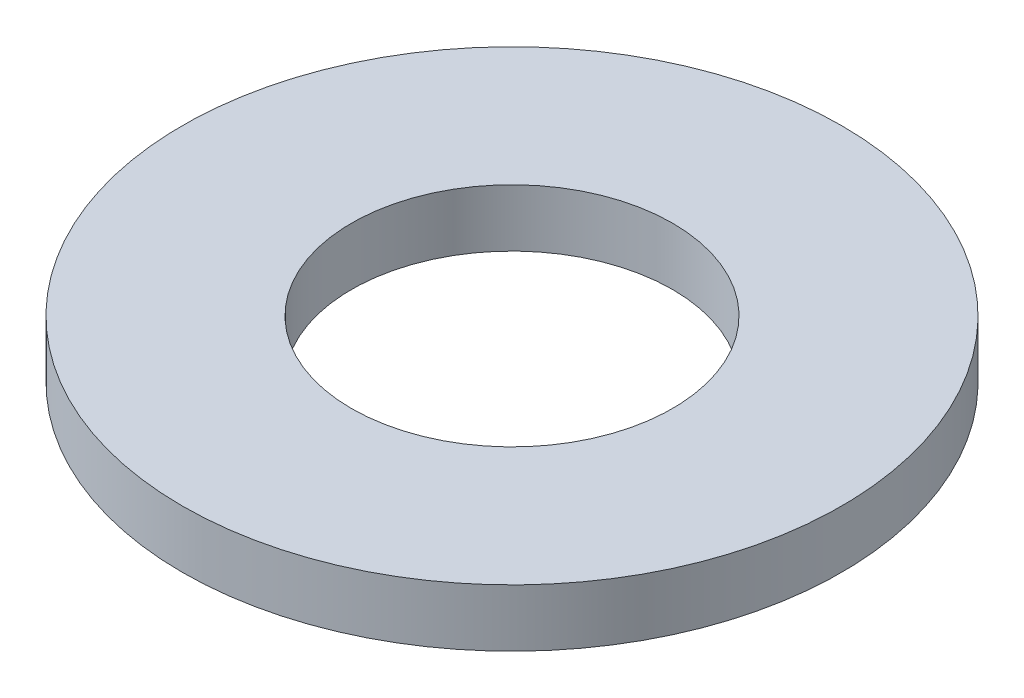
ISO-10303-21;
HEADER;
FILE_DESCRIPTION(('STEP AP214'),'2;1');
FILE_NAME('part.step','',(''),(''),'','','');
FILE_SCHEMA(('AUTOMOTIVE_DESIGN { 1 0 10303 214 1 1 1 1 }'));
ENDSEC;
DATA;
#1=APPLICATION_CONTEXT('core data for automotive mechanical design processes');
#2=APPLICATION_PROTOCOL_DEFINITION('international standard','automotive_design',2000,#1);
#3=PRODUCT_CONTEXT('',#1,'mechanical');
#4=PRODUCT('Part','Part','',(#3));
#5=PRODUCT_RELATED_PRODUCT_CATEGORY('part','',(#4));
#6=PRODUCT_DEFINITION_FORMATION('','',#4);
#7=PRODUCT_DEFINITION_CONTEXT('part definition',#1,'design');
#8=PRODUCT_DEFINITION('design','',#6,#7);
#9=PRODUCT_DEFINITION_SHAPE('','',#8);
#10=(LENGTH_UNIT() NAMED_UNIT(*) SI_UNIT(.MILLI.,.METRE.));
#11=(NAMED_UNIT(*) PLANE_ANGLE_UNIT() SI_UNIT($,.RADIAN.));
#12=(NAMED_UNIT(*) SI_UNIT($,.STERADIAN.) SOLID_ANGLE_UNIT());
#13=UNCERTAINTY_MEASURE_WITH_UNIT(LENGTH_MEASURE(1.E-05),#10,'distance_accuracy_value','');
#14=(GEOMETRIC_REPRESENTATION_CONTEXT(3) GLOBAL_UNCERTAINTY_ASSIGNED_CONTEXT((#13)) GLOBAL_UNIT_ASSIGNED_CONTEXT((#10,
#11,#12)) REPRESENTATION_CONTEXT('',''));
#15=CARTESIAN_POINT('',(0.,0.,0.));
#16=DIRECTION('',(0.,0.,1.));
#17=DIRECTION('',(1.,0.,0.));
#18=AXIS2_PLACEMENT_3D('',#15,#16,#17);
#19=CARTESIAN_POINT('',(0.,17.,0.));
#20=DIRECTION('',(0.,-1.,0.));
#21=DIRECTION('',(0.,0.,-1.));
#22=AXIS2_PLACEMENT_3D('',#19,#20,#21);
#23=CYLINDRICAL_SURFACE('',#22,97.5);
#24=CARTESIAN_POINT('',(0.,17.,0.));
#25=DIRECTION('',(0.,1.,0.));
#26=DIRECTION('',(0.,0.,1.));
#27=AXIS2_PLACEMENT_3D('',#24,#25,#26);
#28=CIRCLE('',#27,97.5);
#29=CARTESIAN_POINT('',(0.,17.,97.5));
#30=VERTEX_POINT('',#29);
#31=EDGE_CURVE('E10',#30,#30,#28,.T.);
#32=ORIENTED_EDGE('',*,*,#31,.F.);
#33=EDGE_LOOP('',(#32));
#34=FACE_BOUND('',#33,.T.);
#35=CARTESIAN_POINT('',(0.,0.,0.));
#36=DIRECTION('',(0.,1.,0.));
#37=DIRECTION('',(0.,0.,1.));
#38=AXIS2_PLACEMENT_3D('',#35,#36,#37);
#39=CIRCLE('',#38,97.5);
#40=CARTESIAN_POINT('',(0.,0.,97.5));
#41=VERTEX_POINT('',#40);
#42=EDGE_CURVE('E37',#41,#41,#39,.T.);
#43=ORIENTED_EDGE('',*,*,#42,.T.);
#44=EDGE_LOOP('',(#43));
#45=FACE_BOUND('',#44,.T.);
#46=ADVANCED_FACE('F40',(#34,#45),#23,.T.);
#47=CARTESIAN_POINT('',(0.,17.,0.));
#48=DIRECTION('',(0.,1.,0.));
#49=DIRECTION('',(0.,0.,1.));
#50=AXIS2_PLACEMENT_3D('',#47,#48,#49);
#51=PLANE('',#50);
#52=CARTESIAN_POINT('',(0.,17.,0.));
#53=DIRECTION('',(0.,1.,0.));
#54=DIRECTION('',(0.,0.,1.));
#55=AXIS2_PLACEMENT_3D('',#52,#53,#54);
#56=CIRCLE('',#55,47.5);
#57=CARTESIAN_POINT('',(0.,17.,47.5));
#58=VERTEX_POINT('',#57);
#59=EDGE_CURVE('E50',#58,#58,#56,.T.);
#60=ORIENTED_EDGE('',*,*,#59,.F.);
#61=EDGE_LOOP('',(#60));
#62=FACE_BOUND('',#61,.T.);
#63=ORIENTED_EDGE('',*,*,#31,.T.);
#64=EDGE_LOOP('',(#63));
#65=FACE_BOUND('',#64,.T.);
#66=ADVANCED_FACE('F59',(#62,#65),#51,.T.);
#67=CARTESIAN_POINT('',(0.,0.,0.));
#68=DIRECTION('',(0.,1.,0.));
#69=DIRECTION('',(0.,0.,1.));
#70=AXIS2_PLACEMENT_3D('',#67,#68,#69);
#71=PLANE('',#70);
#72=CARTESIAN_POINT('',(0.,0.,0.));
#73=DIRECTION('',(0.,1.,0.));
#74=DIRECTION('',(0.,0.,1.));
#75=AXIS2_PLACEMENT_3D('',#72,#73,#74);
#76=CIRCLE('',#75,47.5);
#77=CARTESIAN_POINT('',(0.,0.,47.5));
#78=VERTEX_POINT('',#77);
#79=EDGE_CURVE('E47',#78,#78,#76,.T.);
#80=ORIENTED_EDGE('',*,*,#79,.T.);
#81=EDGE_LOOP('',(#80));
#82=FACE_BOUND('',#81,.T.);
#83=ORIENTED_EDGE('',*,*,#42,.F.);
#84=EDGE_LOOP('',(#83));
#85=FACE_BOUND('',#84,.T.);
#86=ADVANCED_FACE('F58',(#82,#85),#71,.F.);
#87=CARTESIAN_POINT('',(0.,17.,0.));
#88=DIRECTION('',(0.,-1.,0.));
#89=DIRECTION('',(0.,0.,-1.));
#90=AXIS2_PLACEMENT_3D('',#87,#88,#89);
#91=CYLINDRICAL_SURFACE('',#90,47.5);
#92=ORIENTED_EDGE('',*,*,#59,.T.);
#93=EDGE_LOOP('',(#92));
#94=FACE_BOUND('',#93,.T.);
#95=ORIENTED_EDGE('',*,*,#79,.F.);
#96=EDGE_LOOP('',(#95));
#97=FACE_BOUND('',#96,.T.);
#98=ADVANCED_FACE('F54',(#94,#97),#91,.F.);
#99=CLOSED_SHELL('',(#46,#66,#86,#98));
#100=MANIFOLD_SOLID_BREP('B2',#99);
#101=ADVANCED_BREP_SHAPE_REPRESENTATION('',(#18,#100),#14);
#102=SHAPE_DEFINITION_REPRESENTATION(#9,#101);
ENDSEC;
END-ISO-10303-21;
